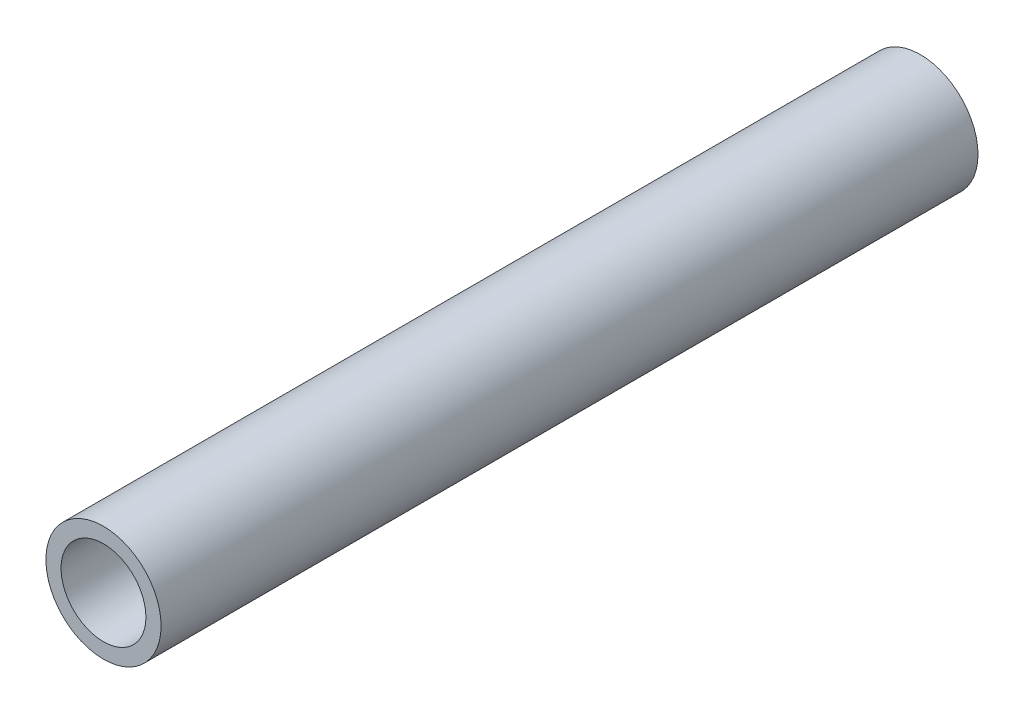
ISO-10303-21;
HEADER;
FILE_DESCRIPTION(('STEP AP214'),'2;1');
FILE_NAME('part.step','',(''),(''),'','','');
FILE_SCHEMA(('AUTOMOTIVE_DESIGN { 1 0 10303 214 1 1 1 1 }'));
ENDSEC;
DATA;
#1=APPLICATION_CONTEXT('core data for automotive mechanical design processes');
#2=APPLICATION_PROTOCOL_DEFINITION('international standard','automotive_design',2000,#1);
#3=PRODUCT_CONTEXT('',#1,'mechanical');
#4=PRODUCT('Part','Part','',(#3));
#5=PRODUCT_RELATED_PRODUCT_CATEGORY('part','',(#4));
#6=PRODUCT_DEFINITION_FORMATION('','',#4);
#7=PRODUCT_DEFINITION_CONTEXT('part definition',#1,'design');
#8=PRODUCT_DEFINITION('design','',#6,#7);
#9=PRODUCT_DEFINITION_SHAPE('','',#8);
#10=(LENGTH_UNIT() NAMED_UNIT(*) SI_UNIT(.MILLI.,.METRE.));
#11=(NAMED_UNIT(*) PLANE_ANGLE_UNIT() SI_UNIT($,.RADIAN.));
#12=(NAMED_UNIT(*) SI_UNIT($,.STERADIAN.) SOLID_ANGLE_UNIT());
#13=UNCERTAINTY_MEASURE_WITH_UNIT(LENGTH_MEASURE(1.E-05),#10,'distance_accuracy_value','');
#14=(GEOMETRIC_REPRESENTATION_CONTEXT(3) GLOBAL_UNCERTAINTY_ASSIGNED_CONTEXT((#13)) GLOBAL_UNIT_ASSIGNED_CONTEXT((#10,
#11,#12)) REPRESENTATION_CONTEXT('',''));
#15=CARTESIAN_POINT('',(0.,0.,0.));
#16=DIRECTION('',(0.,0.,1.));
#17=DIRECTION('',(1.,0.,0.));
#18=AXIS2_PLACEMENT_3D('',#15,#16,#17);
#19=CARTESIAN_POINT('',(0.,0.,68.453));
#20=DIRECTION('',(0.,0.,1.));
#21=DIRECTION('',(1.,0.,0.));
#22=AXIS2_PLACEMENT_3D('',#19,#20,#21);
#23=PLANE('',#22);
#24=CARTESIAN_POINT('',(0.,0.,68.453));
#25=DIRECTION('',(0.,0.,1.));
#26=DIRECTION('',(1.,0.,0.));
#27=AXIS2_PLACEMENT_3D('',#24,#25,#26);
#28=CIRCLE('',#27,4.826);
#29=CARTESIAN_POINT('',(4.826,0.,68.453));
#30=VERTEX_POINT('',#29);
#31=EDGE_CURVE('E10',#30,#30,#28,.T.);
#32=ORIENTED_EDGE('',*,*,#31,.T.);
#33=EDGE_LOOP('',(#32));
#34=FACE_BOUND('',#33,.T.);
#35=CARTESIAN_POINT('',(0.,0.,68.453));
#36=DIRECTION('',(0.,0.,1.));
#37=DIRECTION('',(1.,0.,0.));
#38=AXIS2_PLACEMENT_3D('',#35,#36,#37);
#39=CIRCLE('',#38,3.556);
#40=CARTESIAN_POINT('',(3.556,0.,68.453));
#41=VERTEX_POINT('',#40);
#42=EDGE_CURVE('E41',#41,#41,#39,.T.);
#43=ORIENTED_EDGE('',*,*,#42,.F.);
#44=EDGE_LOOP('',(#43));
#45=FACE_BOUND('',#44,.T.);
#46=ADVANCED_FACE('F30',(#34,#45),#23,.T.);
#47=CARTESIAN_POINT('',(0.,0.,0.));
#48=DIRECTION('',(0.,0.,1.));
#49=DIRECTION('',(1.,0.,0.));
#50=AXIS2_PLACEMENT_3D('',#47,#48,#49);
#51=PLANE('',#50);
#52=CARTESIAN_POINT('',(0.,0.,0.));
#53=DIRECTION('',(0.,0.,1.));
#54=DIRECTION('',(1.,0.,0.));
#55=AXIS2_PLACEMENT_3D('',#52,#53,#54);
#56=CIRCLE('',#55,4.826);
#57=CARTESIAN_POINT('',(4.826,0.,0.));
#58=VERTEX_POINT('',#57);
#59=EDGE_CURVE('E34',#58,#58,#56,.T.);
#60=ORIENTED_EDGE('',*,*,#59,.F.);
#61=EDGE_LOOP('',(#60));
#62=FACE_BOUND('',#61,.T.);
#63=CARTESIAN_POINT('',(0.,0.,0.));
#64=DIRECTION('',(0.,0.,1.));
#65=DIRECTION('',(1.,0.,0.));
#66=AXIS2_PLACEMENT_3D('',#63,#64,#65);
#67=CIRCLE('',#66,3.556);
#68=CARTESIAN_POINT('',(3.556,0.,0.));
#69=VERTEX_POINT('',#68);
#70=EDGE_CURVE('E43',#69,#69,#67,.T.);
#71=ORIENTED_EDGE('',*,*,#70,.T.);
#72=EDGE_LOOP('',(#71));
#73=FACE_BOUND('',#72,.T.);
#74=ADVANCED_FACE('F53',(#62,#73),#51,.F.);
#75=CARTESIAN_POINT('',(0.,0.,68.453));
#76=DIRECTION('',(0.,0.,-1.));
#77=DIRECTION('',(-1.,0.,0.));
#78=AXIS2_PLACEMENT_3D('',#75,#76,#77);
#79=CYLINDRICAL_SURFACE('',#78,4.826);
#80=ORIENTED_EDGE('',*,*,#31,.F.);
#81=EDGE_LOOP('',(#80));
#82=FACE_BOUND('',#81,.T.);
#83=ORIENTED_EDGE('',*,*,#59,.T.);
#84=EDGE_LOOP('',(#83));
#85=FACE_BOUND('',#84,.T.);
#86=ADVANCED_FACE('F32',(#82,#85),#79,.T.);
#87=CARTESIAN_POINT('',(0.,0.,68.453));
#88=DIRECTION('',(0.,0.,-1.));
#89=DIRECTION('',(-1.,0.,0.));
#90=AXIS2_PLACEMENT_3D('',#87,#88,#89);
#91=CYLINDRICAL_SURFACE('',#90,3.556);
#92=ORIENTED_EDGE('',*,*,#42,.T.);
#93=EDGE_LOOP('',(#92));
#94=FACE_BOUND('',#93,.T.);
#95=ORIENTED_EDGE('',*,*,#70,.F.);
#96=EDGE_LOOP('',(#95));
#97=FACE_BOUND('',#96,.T.);
#98=ADVANCED_FACE('F49',(#94,#97),#91,.F.);
#99=CLOSED_SHELL('',(#46,#74,#86,#98));
#100=MANIFOLD_SOLID_BREP('B2',#99);
#101=ADVANCED_BREP_SHAPE_REPRESENTATION('',(#18,#100),#14);
#102=SHAPE_DEFINITION_REPRESENTATION(#9,#101);
ENDSEC;
END-ISO-10303-21;
